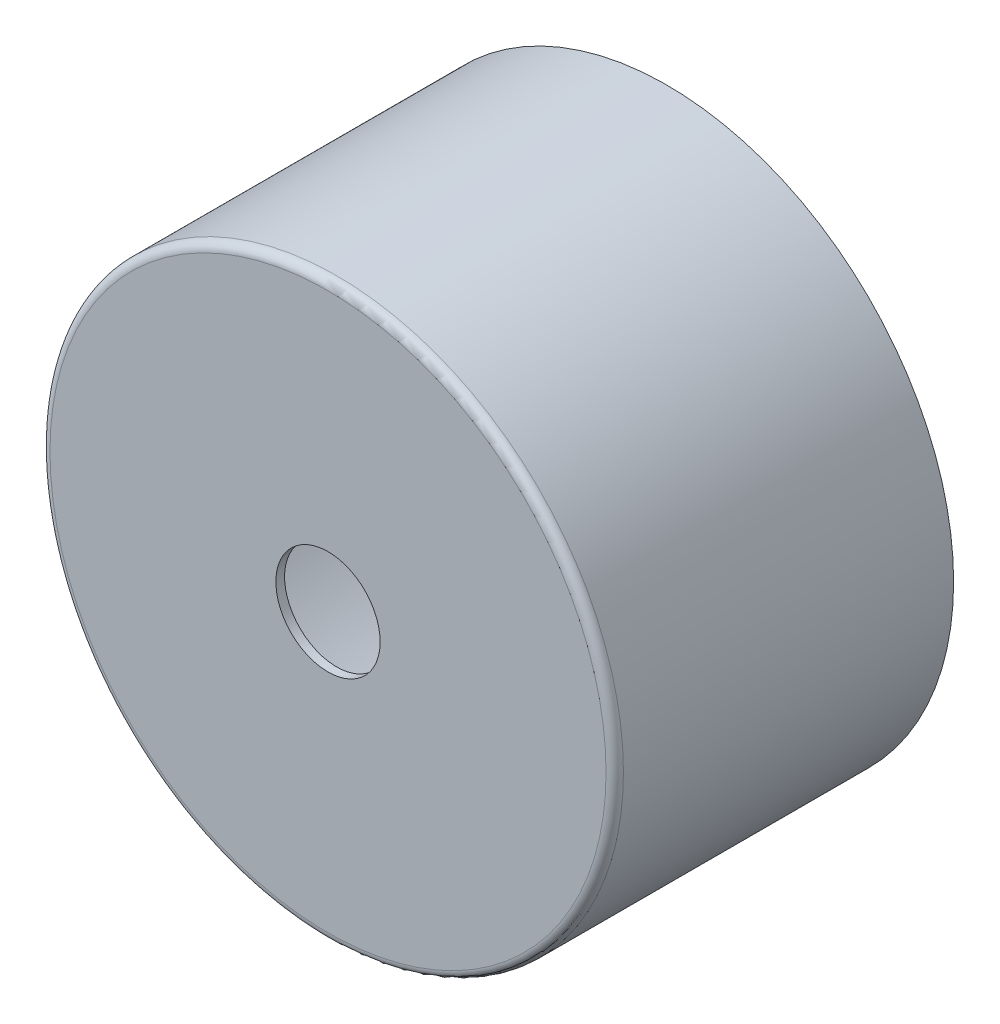
ISO-10303-21;
HEADER;
FILE_DESCRIPTION(('STEP AP214'),'2;1');
FILE_NAME('part.step','',(''),(''),'','','');
FILE_SCHEMA(('AUTOMOTIVE_DESIGN { 1 0 10303 214 1 1 1 1 }'));
ENDSEC;
DATA;
#1=APPLICATION_CONTEXT('core data for automotive mechanical design processes');
#2=APPLICATION_PROTOCOL_DEFINITION('international standard','automotive_design',2000,#1);
#3=PRODUCT_CONTEXT('',#1,'mechanical');
#4=PRODUCT('Part','Part','',(#3));
#5=PRODUCT_RELATED_PRODUCT_CATEGORY('part','',(#4));
#6=PRODUCT_DEFINITION_FORMATION('','',#4);
#7=PRODUCT_DEFINITION_CONTEXT('part definition',#1,'design');
#8=PRODUCT_DEFINITION('design','',#6,#7);
#9=PRODUCT_DEFINITION_SHAPE('','',#8);
#10=(LENGTH_UNIT() NAMED_UNIT(*) SI_UNIT(.MILLI.,.METRE.));
#11=(NAMED_UNIT(*) PLANE_ANGLE_UNIT() SI_UNIT($,.RADIAN.));
#12=(NAMED_UNIT(*) SI_UNIT($,.STERADIAN.) SOLID_ANGLE_UNIT());
#13=UNCERTAINTY_MEASURE_WITH_UNIT(LENGTH_MEASURE(1.E-05),#10,'distance_accuracy_value','');
#14=(GEOMETRIC_REPRESENTATION_CONTEXT(3) GLOBAL_UNCERTAINTY_ASSIGNED_CONTEXT((#13)) GLOBAL_UNIT_ASSIGNED_CONTEXT((#10,
#11,#12)) REPRESENTATION_CONTEXT('',''));
#15=CARTESIAN_POINT('',(0.,0.,0.));
#16=DIRECTION('',(0.,0.,1.));
#17=DIRECTION('',(1.,0.,0.));
#18=AXIS2_PLACEMENT_3D('',#15,#16,#17);
#19=CARTESIAN_POINT('',(0.,0.,-19.5));
#20=DIRECTION('',(0.,0.,1.));
#21=DIRECTION('',(1.,0.,0.));
#22=AXIS2_PLACEMENT_3D('',#19,#20,#21);
#23=CYLINDRICAL_SURFACE('',#22,16.5);
#24=CARTESIAN_POINT('',(0.,0.,-0.5));
#25=DIRECTION('',(0.,0.,1.));
#26=DIRECTION('',(1.,0.,0.));
#27=AXIS2_PLACEMENT_3D('',#24,#25,#26);
#28=CIRCLE('',#27,16.5);
#29=CARTESIAN_POINT('',(16.5,0.,-0.5));
#30=VERTEX_POINT('',#29);
#31=EDGE_CURVE('E10',#30,#30,#28,.F.);
#32=ORIENTED_EDGE('',*,*,#31,.T.);
#33=EDGE_LOOP('',(#32));
#34=FACE_BOUND('',#33,.T.);
#35=CARTESIAN_POINT('',(0.,0.,-19.5));
#36=DIRECTION('',(0.,0.,1.));
#37=DIRECTION('',(1.,0.,0.));
#38=AXIS2_PLACEMENT_3D('',#35,#36,#37);
#39=CIRCLE('',#38,16.5);
#40=CARTESIAN_POINT('',(16.5,0.,-19.5));
#41=VERTEX_POINT('',#40);
#42=EDGE_CURVE('E43',#41,#41,#39,.T.);
#43=ORIENTED_EDGE('',*,*,#42,.T.);
#44=EDGE_LOOP('',(#43));
#45=FACE_BOUND('',#44,.T.);
#46=ADVANCED_FACE('F32',(#34,#45),#23,.T.);
#47=CARTESIAN_POINT('',(0.,0.,-19.5));
#48=DIRECTION('',(0.,0.,1.));
#49=DIRECTION('',(1.,0.,0.));
#50=AXIS2_PLACEMENT_3D('',#47,#48,#49);
#51=PLANE('',#50);
#52=CARTESIAN_POINT('',(0.,0.,-19.5));
#53=DIRECTION('',(0.,0.,1.));
#54=DIRECTION('',(1.,0.,0.));
#55=AXIS2_PLACEMENT_3D('',#52,#53,#54);
#56=CIRCLE('',#55,16.);
#57=CARTESIAN_POINT('',(16.,0.,-19.5));
#58=VERTEX_POINT('',#57);
#59=EDGE_CURVE('E47',#58,#58,#56,.T.);
#60=ORIENTED_EDGE('',*,*,#59,.T.);
#61=EDGE_LOOP('',(#60));
#62=FACE_BOUND('',#61,.T.);
#63=ORIENTED_EDGE('',*,*,#42,.F.);
#64=EDGE_LOOP('',(#63));
#65=FACE_BOUND('',#64,.T.);
#66=ADVANCED_FACE('F68',(#62,#65),#51,.F.);
#67=CARTESIAN_POINT('',(0.,0.,0.));
#68=DIRECTION('',(0.,0.,1.));
#69=DIRECTION('',(1.,0.,0.));
#70=AXIS2_PLACEMENT_3D('',#67,#68,#69);
#71=PLANE('',#70);
#72=CARTESIAN_POINT('',(0.,0.,0.));
#73=DIRECTION('',(0.,0.,1.));
#74=DIRECTION('',(1.,0.,0.));
#75=AXIS2_PLACEMENT_3D('',#72,#73,#74);
#76=CIRCLE('',#75,16.);
#77=CARTESIAN_POINT('',(16.,0.,0.));
#78=VERTEX_POINT('',#77);
#79=EDGE_CURVE('E39',#78,#78,#76,.T.);
#80=ORIENTED_EDGE('',*,*,#79,.T.);
#81=EDGE_LOOP('',(#80));
#82=FACE_BOUND('',#81,.T.);
#83=CARTESIAN_POINT('',(0.,0.,0.));
#84=DIRECTION('',(0.,0.,1.));
#85=DIRECTION('',(1.,0.,0.));
#86=AXIS2_PLACEMENT_3D('',#83,#84,#85);
#87=CIRCLE('',#86,3.);
#88=CARTESIAN_POINT('',(3.,0.,0.));
#89=VERTEX_POINT('',#88);
#90=EDGE_CURVE('E53',#89,#89,#87,.T.);
#91=ORIENTED_EDGE('',*,*,#90,.F.);
#92=EDGE_LOOP('',(#91));
#93=FACE_BOUND('',#92,.T.);
#94=ADVANCED_FACE('F65',(#82,#93),#71,.T.);
#95=CARTESIAN_POINT('',(0.,0.,-19.5));
#96=DIRECTION('',(0.,0.,1.));
#97=DIRECTION('',(1.,0.,0.));
#98=AXIS2_PLACEMENT_3D('',#95,#96,#97);
#99=CYLINDRICAL_SURFACE('',#98,16.);
#100=ORIENTED_EDGE('',*,*,#59,.F.);
#101=EDGE_LOOP('',(#100));
#102=FACE_BOUND('',#101,.T.);
#103=CARTESIAN_POINT('',(0.,0.,-0.5));
#104=DIRECTION('',(0.,0.,1.));
#105=DIRECTION('',(1.,0.,0.));
#106=AXIS2_PLACEMENT_3D('',#103,#104,#105);
#107=CIRCLE('',#106,16.);
#108=CARTESIAN_POINT('',(16.,0.,-0.5));
#109=VERTEX_POINT('',#108);
#110=EDGE_CURVE('E52',#109,#109,#107,.T.);
#111=ORIENTED_EDGE('',*,*,#110,.T.);
#112=EDGE_LOOP('',(#111));
#113=FACE_BOUND('',#112,.T.);
#114=ADVANCED_FACE('F67',(#102,#113),#99,.F.);
#115=CARTESIAN_POINT('',(0.,0.,-0.5));
#116=DIRECTION('',(0.,0.,1.));
#117=DIRECTION('',(1.,0.,0.));
#118=AXIS2_PLACEMENT_3D('',#115,#116,#117);
#119=PLANE('',#118);
#120=CARTESIAN_POINT('',(0.,0.,-0.5));
#121=DIRECTION('',(0.,0.,1.));
#122=DIRECTION('',(1.,0.,0.));
#123=AXIS2_PLACEMENT_3D('',#120,#121,#122);
#124=CIRCLE('',#123,3.);
#125=CARTESIAN_POINT('',(3.,0.,-0.5));
#126=VERTEX_POINT('',#125);
#127=EDGE_CURVE('E50',#126,#126,#124,.T.);
#128=ORIENTED_EDGE('',*,*,#127,.T.);
#129=EDGE_LOOP('',(#128));
#130=FACE_BOUND('',#129,.T.);
#131=ORIENTED_EDGE('',*,*,#110,.F.);
#132=EDGE_LOOP('',(#131));
#133=FACE_BOUND('',#132,.T.);
#134=ADVANCED_FACE('F74',(#130,#133),#119,.F.);
#135=CARTESIAN_POINT('',(0.,0.,-19.5));
#136=DIRECTION('',(0.,0.,1.));
#137=DIRECTION('',(1.,0.,0.));
#138=AXIS2_PLACEMENT_3D('',#135,#136,#137);
#139=CYLINDRICAL_SURFACE('',#138,3.);
#140=ORIENTED_EDGE('',*,*,#90,.T.);
#141=EDGE_LOOP('',(#140));
#142=FACE_BOUND('',#141,.T.);
#143=ORIENTED_EDGE('',*,*,#127,.F.);
#144=EDGE_LOOP('',(#143));
#145=FACE_BOUND('',#144,.T.);
#146=ADVANCED_FACE('F62',(#142,#145),#139,.F.);
#147=CARTESIAN_POINT('',(0.,0.,-0.5));
#148=DIRECTION('',(0.,0.,1.));
#149=DIRECTION('',(1.,0.,0.));
#150=AXIS2_PLACEMENT_3D('',#147,#148,#149);
#151=TOROIDAL_SURFACE('',#150,16.,0.5);
#152=ORIENTED_EDGE('',*,*,#31,.F.);
#153=EDGE_LOOP('',(#152));
#154=FACE_BOUND('',#153,.T.);
#155=ORIENTED_EDGE('',*,*,#79,.F.);
#156=EDGE_LOOP('',(#155));
#157=FACE_BOUND('',#156,.T.);
#158=ADVANCED_FACE('F34',(#154,#157),#151,.T.);
#159=CLOSED_SHELL('',(#46,#66,#94,#114,#134,#146,#158));
#160=MANIFOLD_SOLID_BREP('B2',#159);
#161=ADVANCED_BREP_SHAPE_REPRESENTATION('',(#18,#160),#14);
#162=SHAPE_DEFINITION_REPRESENTATION(#9,#161);
ENDSEC;
END-ISO-10303-21;
